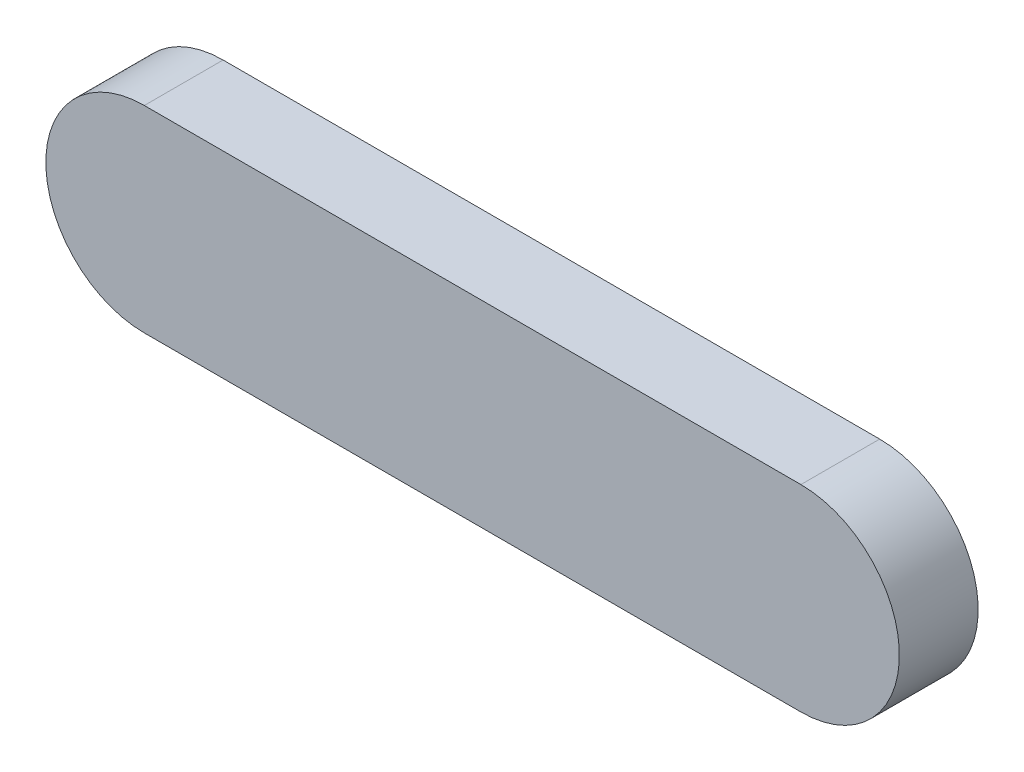
ISO-10303-21;
HEADER;
FILE_DESCRIPTION(('STEP AP214'),'2;1');
FILE_NAME('part.step','',(''),(''),'','','');
FILE_SCHEMA(('AUTOMOTIVE_DESIGN { 1 0 10303 214 1 1 1 1 }'));
ENDSEC;
DATA;
#1=APPLICATION_CONTEXT('core data for automotive mechanical design processes');
#2=APPLICATION_PROTOCOL_DEFINITION('international standard','automotive_design',2000,#1);
#3=PRODUCT_CONTEXT('',#1,'mechanical');
#4=PRODUCT('Part','Part','',(#3));
#5=PRODUCT_RELATED_PRODUCT_CATEGORY('part','',(#4));
#6=PRODUCT_DEFINITION_FORMATION('','',#4);
#7=PRODUCT_DEFINITION_CONTEXT('part definition',#1,'design');
#8=PRODUCT_DEFINITION('design','',#6,#7);
#9=PRODUCT_DEFINITION_SHAPE('','',#8);
#10=(LENGTH_UNIT() NAMED_UNIT(*) SI_UNIT(.MILLI.,.METRE.));
#11=(NAMED_UNIT(*) PLANE_ANGLE_UNIT() SI_UNIT($,.RADIAN.));
#12=(NAMED_UNIT(*) SI_UNIT($,.STERADIAN.) SOLID_ANGLE_UNIT());
#13=UNCERTAINTY_MEASURE_WITH_UNIT(LENGTH_MEASURE(1.E-05),#10,'distance_accuracy_value','');
#14=(GEOMETRIC_REPRESENTATION_CONTEXT(3) GLOBAL_UNCERTAINTY_ASSIGNED_CONTEXT((#13)) GLOBAL_UNIT_ASSIGNED_CONTEXT((#10,
#11,#12)) REPRESENTATION_CONTEXT('',''));
#15=CARTESIAN_POINT('',(0.,0.,0.));
#16=DIRECTION('',(0.,0.,1.));
#17=DIRECTION('',(1.,0.,0.));
#18=AXIS2_PLACEMENT_3D('',#15,#16,#17);
#19=CARTESIAN_POINT('',(-50.,9.99999999999999,12.));
#20=DIRECTION('',(0.,0.,-1.));
#21=DIRECTION('',(-1.,0.,0.));
#22=AXIS2_PLACEMENT_3D('',#19,#20,#21);
#23=CYLINDRICAL_SURFACE('',#22,15.);
#24=CARTESIAN_POINT('',(-50.,9.99999999999999,0.));
#25=DIRECTION('',(0.,0.,1.));
#26=DIRECTION('',(1.,0.,0.));
#27=AXIS2_PLACEMENT_3D('',#24,#25,#26);
#28=CIRCLE('',#27,15.);
#29=CARTESIAN_POINT('',(-50.,25.,0.));
#30=VERTEX_POINT('',#29);
#31=CARTESIAN_POINT('',(-50.,-5.00000000000001,0.));
#32=VERTEX_POINT('',#31);
#33=EDGE_CURVE('E96',#30,#32,#28,.T.);
#34=ORIENTED_EDGE('',*,*,#33,.T.);
#35=DIRECTION('',(0.,0.,-1.));
#36=VECTOR('',#35,1.);
#37=CARTESIAN_POINT('',(-50.,-5.00000000000001,12.));
#38=LINE('',#37,#36);
#39=CARTESIAN_POINT('',(-50.,-5.00000000000001,12.));
#40=VERTEX_POINT('',#39);
#41=EDGE_CURVE('E11',#40,#32,#38,.T.);
#42=ORIENTED_EDGE('',*,*,#41,.F.);
#43=CARTESIAN_POINT('',(-50.,9.99999999999999,12.));
#44=DIRECTION('',(0.,0.,1.));
#45=DIRECTION('',(1.,0.,0.));
#46=AXIS2_PLACEMENT_3D('',#43,#44,#45);
#47=CIRCLE('',#46,15.);
#48=CARTESIAN_POINT('',(-50.,25.,12.));
#49=VERTEX_POINT('',#48);
#50=EDGE_CURVE('E84',#49,#40,#47,.T.);
#51=ORIENTED_EDGE('',*,*,#50,.F.);
#52=DIRECTION('',(0.,0.,-1.));
#53=VECTOR('',#52,1.);
#54=CARTESIAN_POINT('',(-50.,25.,12.));
#55=LINE('',#54,#53);
#56=EDGE_CURVE('E92',#49,#30,#55,.T.);
#57=ORIENTED_EDGE('',*,*,#56,.T.);
#58=EDGE_LOOP('',(#34,#42,#51,#57));
#59=FACE_BOUND('',#58,.T.);
#60=ADVANCED_FACE('F33',(#59),#23,.T.);
#61=CARTESIAN_POINT('',(-50.,-5.00000000000001,12.));
#62=DIRECTION('',(0.,1.,0.));
#63=DIRECTION('',(-1.,0.,0.));
#64=AXIS2_PLACEMENT_3D('',#61,#62,#63);
#65=PLANE('',#64);
#66=DIRECTION('',(1.,0.,0.));
#67=VECTOR('',#66,1.);
#68=CARTESIAN_POINT('',(-50.,-5.00000000000001,0.));
#69=LINE('',#68,#67);
#70=CARTESIAN_POINT('',(50.,-5.,0.));
#71=VERTEX_POINT('',#70);
#72=EDGE_CURVE('E88',#32,#71,#69,.T.);
#73=ORIENTED_EDGE('',*,*,#72,.T.);
#74=DIRECTION('',(0.,0.,-1.));
#75=VECTOR('',#74,1.);
#76=CARTESIAN_POINT('',(50.,-5.,12.));
#77=LINE('',#76,#75);
#78=CARTESIAN_POINT('',(50.,-5.,12.));
#79=VERTEX_POINT('',#78);
#80=EDGE_CURVE('E41',#79,#71,#77,.T.);
#81=ORIENTED_EDGE('',*,*,#80,.F.);
#82=DIRECTION('',(1.,0.,0.));
#83=VECTOR('',#82,1.);
#84=CARTESIAN_POINT('',(-50.,-5.00000000000001,12.));
#85=LINE('',#84,#83);
#86=EDGE_CURVE('E79',#40,#79,#85,.T.);
#87=ORIENTED_EDGE('',*,*,#86,.F.);
#88=ORIENTED_EDGE('',*,*,#41,.T.);
#89=EDGE_LOOP('',(#73,#81,#87,#88));
#90=FACE_BOUND('',#89,.T.);
#91=ADVANCED_FACE('F87',(#90),#65,.F.);
#92=CARTESIAN_POINT('',(50.,9.99999999999999,12.));
#93=DIRECTION('',(0.,0.,-1.));
#94=DIRECTION('',(-1.,0.,0.));
#95=AXIS2_PLACEMENT_3D('',#92,#93,#94);
#96=CYLINDRICAL_SURFACE('',#95,15.);
#97=CARTESIAN_POINT('',(50.,9.99999999999999,0.));
#98=DIRECTION('',(0.,0.,1.));
#99=DIRECTION('',(1.,0.,0.));
#100=AXIS2_PLACEMENT_3D('',#97,#98,#99);
#101=CIRCLE('',#100,15.);
#102=CARTESIAN_POINT('',(50.,25.,0.));
#103=VERTEX_POINT('',#102);
#104=EDGE_CURVE('E66',#71,#103,#101,.T.);
#105=ORIENTED_EDGE('',*,*,#104,.T.);
#106=DIRECTION('',(0.,0.,-1.));
#107=VECTOR('',#106,1.);
#108=CARTESIAN_POINT('',(50.,25.,12.));
#109=LINE('',#108,#107);
#110=CARTESIAN_POINT('',(50.,25.,12.));
#111=VERTEX_POINT('',#110);
#112=EDGE_CURVE('E89',#111,#103,#109,.T.);
#113=ORIENTED_EDGE('',*,*,#112,.F.);
#114=CARTESIAN_POINT('',(50.,9.99999999999999,12.));
#115=DIRECTION('',(0.,0.,1.));
#116=DIRECTION('',(1.,0.,0.));
#117=AXIS2_PLACEMENT_3D('',#114,#115,#116);
#118=CIRCLE('',#117,15.);
#119=EDGE_CURVE('E82',#79,#111,#118,.T.);
#120=ORIENTED_EDGE('',*,*,#119,.F.);
#121=ORIENTED_EDGE('',*,*,#80,.T.);
#122=EDGE_LOOP('',(#105,#113,#120,#121));
#123=FACE_BOUND('',#122,.T.);
#124=ADVANCED_FACE('F90',(#123),#96,.T.);
#125=CARTESIAN_POINT('',(-50.,25.,12.));
#126=DIRECTION('',(0.,-1.,0.));
#127=DIRECTION('',(0.,0.,-1.));
#128=AXIS2_PLACEMENT_3D('',#125,#126,#127);
#129=PLANE('',#128);
#130=DIRECTION('',(-1.,0.,0.));
#131=VECTOR('',#130,1.);
#132=CARTESIAN_POINT('',(-50.,25.,0.));
#133=LINE('',#132,#131);
#134=EDGE_CURVE('E72',#103,#30,#133,.T.);
#135=ORIENTED_EDGE('',*,*,#134,.T.);
#136=ORIENTED_EDGE('',*,*,#56,.F.);
#137=DIRECTION('',(-1.,0.,0.));
#138=VECTOR('',#137,1.);
#139=CARTESIAN_POINT('',(-50.,25.,12.));
#140=LINE('',#139,#138);
#141=EDGE_CURVE('E49',#111,#49,#140,.T.);
#142=ORIENTED_EDGE('',*,*,#141,.F.);
#143=ORIENTED_EDGE('',*,*,#112,.T.);
#144=EDGE_LOOP('',(#135,#136,#142,#143));
#145=FACE_BOUND('',#144,.T.);
#146=ADVANCED_FACE('F103',(#145),#129,.F.);
#147=CARTESIAN_POINT('',(-50.,9.99999999999999,12.));
#148=DIRECTION('',(0.,0.,1.));
#149=DIRECTION('',(1.,0.,0.));
#150=AXIS2_PLACEMENT_3D('',#147,#148,#149);
#151=PLANE('',#150);
#152=ORIENTED_EDGE('',*,*,#50,.T.);
#153=ORIENTED_EDGE('',*,*,#86,.T.);
#154=ORIENTED_EDGE('',*,*,#119,.T.);
#155=ORIENTED_EDGE('',*,*,#141,.T.);
#156=EDGE_LOOP('',(#152,#153,#154,#155));
#157=FACE_BOUND('',#156,.T.);
#158=ADVANCED_FACE('F80',(#157),#151,.T.);
#159=CARTESIAN_POINT('',(-50.,9.99999999999999,0.));
#160=DIRECTION('',(0.,0.,1.));
#161=DIRECTION('',(1.,0.,0.));
#162=AXIS2_PLACEMENT_3D('',#159,#160,#161);
#163=PLANE('',#162);
#164=ORIENTED_EDGE('',*,*,#33,.F.);
#165=ORIENTED_EDGE('',*,*,#134,.F.);
#166=ORIENTED_EDGE('',*,*,#104,.F.);
#167=ORIENTED_EDGE('',*,*,#72,.F.);
#168=EDGE_LOOP('',(#164,#165,#166,#167));
#169=FACE_BOUND('',#168,.T.);
#170=ADVANCED_FACE('F106',(#169),#163,.F.);
#171=CLOSED_SHELL('',(#60,#91,#124,#146,#158,#170));
#172=MANIFOLD_SOLID_BREP('B2',#171);
#173=ADVANCED_BREP_SHAPE_REPRESENTATION('',(#18,#172),#14);
#174=SHAPE_DEFINITION_REPRESENTATION(#9,#173);
ENDSEC;
END-ISO-10303-21;
